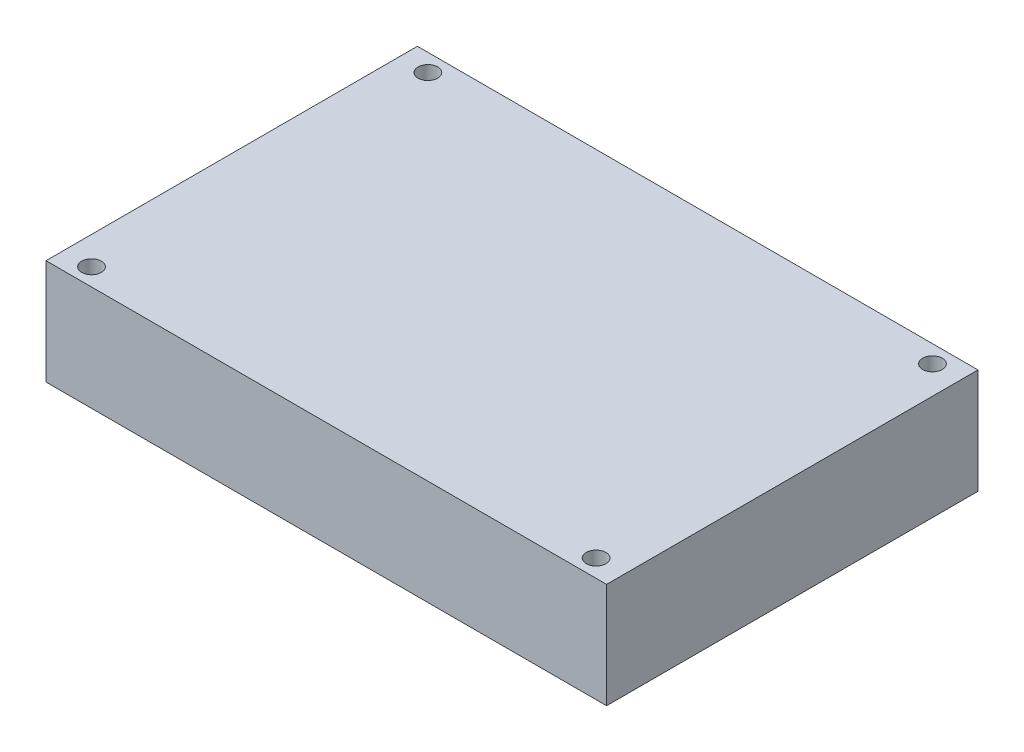
ISO-10303-21;
HEADER;
FILE_DESCRIPTION(('STEP AP214'),'2;1');
FILE_NAME('part.step','',(''),(''),'','','');
FILE_SCHEMA(('AUTOMOTIVE_DESIGN { 1 0 10303 214 1 1 1 1 }'));
ENDSEC;
DATA;
#1=APPLICATION_CONTEXT('core data for automotive mechanical design processes');
#2=APPLICATION_PROTOCOL_DEFINITION('international standard','automotive_design',2000,#1);
#3=PRODUCT_CONTEXT('',#1,'mechanical');
#4=PRODUCT('Part','Part','',(#3));
#5=PRODUCT_RELATED_PRODUCT_CATEGORY('part','',(#4));
#6=PRODUCT_DEFINITION_FORMATION('','',#4);
#7=PRODUCT_DEFINITION_CONTEXT('part definition',#1,'design');
#8=PRODUCT_DEFINITION('design','',#6,#7);
#9=PRODUCT_DEFINITION_SHAPE('','',#8);
#10=(LENGTH_UNIT() NAMED_UNIT(*) SI_UNIT(.MILLI.,.METRE.));
#11=(NAMED_UNIT(*) PLANE_ANGLE_UNIT() SI_UNIT($,.RADIAN.));
#12=(NAMED_UNIT(*) SI_UNIT($,.STERADIAN.) SOLID_ANGLE_UNIT());
#13=UNCERTAINTY_MEASURE_WITH_UNIT(LENGTH_MEASURE(1.E-05),#10,'distance_accuracy_value','');
#14=(GEOMETRIC_REPRESENTATION_CONTEXT(3) GLOBAL_UNCERTAINTY_ASSIGNED_CONTEXT((#13)) GLOBAL_UNIT_ASSIGNED_CONTEXT((#10,
#11,#12)) REPRESENTATION_CONTEXT('',''));
#15=CARTESIAN_POINT('',(0.,0.,0.));
#16=DIRECTION('',(0.,0.,1.));
#17=DIRECTION('',(1.,0.,0.));
#18=AXIS2_PLACEMENT_3D('',#15,#16,#17);
#19=CARTESIAN_POINT('',(0.,15.,0.));
#20=DIRECTION('',(0.,-1.,0.));
#21=DIRECTION('',(0.,0.,-1.));
#22=AXIS2_PLACEMENT_3D('',#19,#20,#21);
#23=PLANE('',#22);
#24=DIRECTION('',(-1.,0.,0.));
#25=VECTOR('',#24,1.);
#26=CARTESIAN_POINT('',(41.5000000000001,15.,-52.9999999999999));
#27=LINE('',#26,#25);
#28=CARTESIAN_POINT('',(80.0000000000001,15.,-52.9999999999999));
#29=VERTEX_POINT('',#28);
#30=CARTESIAN_POINT('',(0.,15.,-52.9999999999999));
#31=VERTEX_POINT('',#30);
#32=EDGE_CURVE('E80',#29,#31,#27,.T.);
#33=ORIENTED_EDGE('',*,*,#32,.T.);
#34=DIRECTION('',(0.,0.,1.));
#35=VECTOR('',#34,1.);
#36=CARTESIAN_POINT('',(0.,15.,0.));
#37=LINE('',#36,#35);
#38=CARTESIAN_POINT('',(0.,15.,0.));
#39=VERTEX_POINT('',#38);
#40=EDGE_CURVE('E83',#31,#39,#37,.T.);
#41=ORIENTED_EDGE('',*,*,#40,.T.);
#42=DIRECTION('',(1.,0.,0.));
#43=VECTOR('',#42,1.);
#44=CARTESIAN_POINT('',(0.,15.,0.));
#45=LINE('',#44,#43);
#46=CARTESIAN_POINT('',(80.0000000000001,15.,0.));
#47=VERTEX_POINT('',#46);
#48=EDGE_CURVE('E87',#39,#47,#45,.T.);
#49=ORIENTED_EDGE('',*,*,#48,.T.);
#50=DIRECTION('',(0.,0.,-1.));
#51=VECTOR('',#50,1.);
#52=CARTESIAN_POINT('',(80.0000000000001,15.,-52.9999999999999));
#53=LINE('',#52,#51);
#54=EDGE_CURVE('E51',#47,#29,#53,.T.);
#55=ORIENTED_EDGE('',*,*,#54,.T.);
#56=EDGE_LOOP('',(#33,#41,#49,#55));
#57=FACE_BOUND('',#56,.T.);
#58=CARTESIAN_POINT('',(76.0000000000001,15.,-50.5));
#59=DIRECTION('',(0.,1.,0.));
#60=DIRECTION('',(0.,0.,1.));
#61=AXIS2_PLACEMENT_3D('',#58,#59,#60);
#62=CIRCLE('',#61,1.39999999999985);
#63=CARTESIAN_POINT('',(76.0000000000001,15.,-49.1000000000001));
#64=VERTEX_POINT('',#63);
#65=EDGE_CURVE('E100',#64,#64,#62,.T.);
#66=ORIENTED_EDGE('',*,*,#65,.F.);
#67=EDGE_LOOP('',(#66));
#68=FACE_BOUND('',#67,.T.);
#69=CARTESIAN_POINT('',(76.0000000000001,15.,-2.49999999999995));
#70=DIRECTION('',(0.,1.,0.));
#71=DIRECTION('',(0.,0.,1.));
#72=AXIS2_PLACEMENT_3D('',#69,#70,#71);
#73=CIRCLE('',#72,1.39999999999985);
#74=CARTESIAN_POINT('',(76.0000000000001,15.,-1.1000000000001));
#75=VERTEX_POINT('',#74);
#76=EDGE_CURVE('E133',#75,#75,#73,.T.);
#77=ORIENTED_EDGE('',*,*,#76,.F.);
#78=EDGE_LOOP('',(#77));
#79=FACE_BOUND('',#78,.T.);
#80=CARTESIAN_POINT('',(4.,15.,-50.5));
#81=DIRECTION('',(0.,1.,0.));
#82=DIRECTION('',(0.,0.,1.));
#83=AXIS2_PLACEMENT_3D('',#80,#81,#82);
#84=CIRCLE('',#83,1.39999999999996);
#85=CARTESIAN_POINT('',(4.,15.,-49.1));
#86=VERTEX_POINT('',#85);
#87=EDGE_CURVE('E128',#86,#86,#84,.T.);
#88=ORIENTED_EDGE('',*,*,#87,.F.);
#89=EDGE_LOOP('',(#88));
#90=FACE_BOUND('',#89,.T.);
#91=CARTESIAN_POINT('',(4.,15.,-2.49999999999995));
#92=DIRECTION('',(0.,1.,0.));
#93=DIRECTION('',(0.,0.,1.));
#94=AXIS2_PLACEMENT_3D('',#91,#92,#93);
#95=CIRCLE('',#94,1.39999999999996);
#96=CARTESIAN_POINT('',(4.,15.,-1.09999999999999));
#97=VERTEX_POINT('',#96);
#98=EDGE_CURVE('E122',#97,#97,#95,.T.);
#99=ORIENTED_EDGE('',*,*,#98,.F.);
#100=EDGE_LOOP('',(#99));
#101=FACE_BOUND('',#100,.T.);
#102=ADVANCED_FACE('F34',(#57,#68,#79,#90,#101),#23,.F.);
#103=CARTESIAN_POINT('',(0.,0.,0.));
#104=DIRECTION('',(0.,-1.,0.));
#105=DIRECTION('',(0.,0.,-1.));
#106=AXIS2_PLACEMENT_3D('',#103,#104,#105);
#107=PLANE('',#106);
#108=CARTESIAN_POINT('',(4.,0.,-50.5));
#109=DIRECTION('',(0.,1.,0.));
#110=DIRECTION('',(0.,0.,1.));
#111=AXIS2_PLACEMENT_3D('',#108,#109,#110);
#112=CIRCLE('',#111,1.39999999999996);
#113=CARTESIAN_POINT('',(4.,0.,-49.1));
#114=VERTEX_POINT('',#113);
#115=EDGE_CURVE('E125',#114,#114,#112,.T.);
#116=ORIENTED_EDGE('',*,*,#115,.T.);
#117=EDGE_LOOP('',(#116));
#118=FACE_BOUND('',#117,.T.);
#119=CARTESIAN_POINT('',(76.0000000000001,0.,-50.5));
#120=DIRECTION('',(0.,1.,0.));
#121=DIRECTION('',(0.,0.,1.));
#122=AXIS2_PLACEMENT_3D('',#119,#120,#121);
#123=CIRCLE('',#122,1.39999999999985);
#124=CARTESIAN_POINT('',(76.0000000000001,0.,-49.1000000000001));
#125=VERTEX_POINT('',#124);
#126=EDGE_CURVE('E136',#125,#125,#123,.T.);
#127=ORIENTED_EDGE('',*,*,#126,.T.);
#128=EDGE_LOOP('',(#127));
#129=FACE_BOUND('',#128,.T.);
#130=DIRECTION('',(-1.,0.,0.));
#131=VECTOR('',#130,1.);
#132=CARTESIAN_POINT('',(0.,0.,-52.9999999999999));
#133=LINE('',#132,#131);
#134=CARTESIAN_POINT('',(80.0000000000001,0.,-52.9999999999999));
#135=VERTEX_POINT('',#134);
#136=CARTESIAN_POINT('',(0.,0.,-52.9999999999999));
#137=VERTEX_POINT('',#136);
#138=EDGE_CURVE('E75',#135,#137,#133,.T.);
#139=ORIENTED_EDGE('',*,*,#138,.F.);
#140=DIRECTION('',(0.,0.,-1.));
#141=VECTOR('',#140,1.);
#142=CARTESIAN_POINT('',(80.0000000000001,0.,-52.9999999999999));
#143=LINE('',#142,#141);
#144=CARTESIAN_POINT('',(80.0000000000001,0.,0.));
#145=VERTEX_POINT('',#144);
#146=EDGE_CURVE('E103',#145,#135,#143,.T.);
#147=ORIENTED_EDGE('',*,*,#146,.F.);
#148=DIRECTION('',(1.,0.,0.));
#149=VECTOR('',#148,1.);
#150=CARTESIAN_POINT('',(0.,0.,0.));
#151=LINE('',#150,#149);
#152=CARTESIAN_POINT('',(0.,0.,0.));
#153=VERTEX_POINT('',#152);
#154=EDGE_CURVE('E68',#153,#145,#151,.T.);
#155=ORIENTED_EDGE('',*,*,#154,.F.);
#156=DIRECTION('',(0.,0.,1.));
#157=VECTOR('',#156,1.);
#158=CARTESIAN_POINT('',(0.,0.,0.));
#159=LINE('',#158,#157);
#160=EDGE_CURVE('E91',#137,#153,#159,.T.);
#161=ORIENTED_EDGE('',*,*,#160,.F.);
#162=EDGE_LOOP('',(#139,#147,#155,#161));
#163=FACE_BOUND('',#162,.T.);
#164=CARTESIAN_POINT('',(76.0000000000001,0.,-2.49999999999995));
#165=DIRECTION('',(0.,1.,0.));
#166=DIRECTION('',(0.,0.,1.));
#167=AXIS2_PLACEMENT_3D('',#164,#165,#166);
#168=CIRCLE('',#167,1.39999999999985);
#169=CARTESIAN_POINT('',(76.0000000000001,0.,-1.1000000000001));
#170=VERTEX_POINT('',#169);
#171=EDGE_CURVE('E117',#170,#170,#168,.T.);
#172=ORIENTED_EDGE('',*,*,#171,.T.);
#173=EDGE_LOOP('',(#172));
#174=FACE_BOUND('',#173,.T.);
#175=CARTESIAN_POINT('',(4.,0.,-2.49999999999995));
#176=DIRECTION('',(0.,1.,0.));
#177=DIRECTION('',(0.,0.,1.));
#178=AXIS2_PLACEMENT_3D('',#175,#176,#177);
#179=CIRCLE('',#178,1.39999999999996);
#180=CARTESIAN_POINT('',(4.,0.,-1.09999999999999));
#181=VERTEX_POINT('',#180);
#182=EDGE_CURVE('E120',#181,#181,#179,.T.);
#183=ORIENTED_EDGE('',*,*,#182,.T.);
#184=EDGE_LOOP('',(#183));
#185=FACE_BOUND('',#184,.T.);
#186=ADVANCED_FACE('F109',(#118,#129,#163,#174,#185),#107,.T.);
#187=CARTESIAN_POINT('',(0.,15.,-52.9999999999999));
#188=DIRECTION('',(0.,0.,1.));
#189=DIRECTION('',(1.,0.,0.));
#190=AXIS2_PLACEMENT_3D('',#187,#188,#189);
#191=PLANE('',#190);
#192=ORIENTED_EDGE('',*,*,#138,.T.);
#193=DIRECTION('',(0.,-1.,0.));
#194=VECTOR('',#193,1.);
#195=CARTESIAN_POINT('',(0.,15.,-52.9999999999999));
#196=LINE('',#195,#194);
#197=EDGE_CURVE('E11',#31,#137,#196,.T.);
#198=ORIENTED_EDGE('',*,*,#197,.F.);
#199=ORIENTED_EDGE('',*,*,#32,.F.);
#200=DIRECTION('',(0.,-1.,0.));
#201=VECTOR('',#200,1.);
#202=CARTESIAN_POINT('',(80.0000000000001,15.,-52.9999999999999));
#203=LINE('',#202,#201);
#204=EDGE_CURVE('E95',#29,#135,#203,.T.);
#205=ORIENTED_EDGE('',*,*,#204,.T.);
#206=EDGE_LOOP('',(#192,#198,#199,#205));
#207=FACE_BOUND('',#206,.T.);
#208=ADVANCED_FACE('F36',(#207),#191,.F.);
#209=CARTESIAN_POINT('',(0.,15.,0.));
#210=DIRECTION('',(1.,0.,0.));
#211=DIRECTION('',(0.,0.,-1.));
#212=AXIS2_PLACEMENT_3D('',#209,#210,#211);
#213=PLANE('',#212);
#214=ORIENTED_EDGE('',*,*,#160,.T.);
#215=DIRECTION('',(0.,-1.,0.));
#216=VECTOR('',#215,1.);
#217=CARTESIAN_POINT('',(0.,15.,0.));
#218=LINE('',#217,#216);
#219=EDGE_CURVE('E43',#39,#153,#218,.T.);
#220=ORIENTED_EDGE('',*,*,#219,.F.);
#221=ORIENTED_EDGE('',*,*,#40,.F.);
#222=ORIENTED_EDGE('',*,*,#197,.T.);
#223=EDGE_LOOP('',(#214,#220,#221,#222));
#224=FACE_BOUND('',#223,.T.);
#225=ADVANCED_FACE('F90',(#224),#213,.F.);
#226=CARTESIAN_POINT('',(0.,15.,0.));
#227=DIRECTION('',(0.,0.,-1.));
#228=DIRECTION('',(-1.,0.,0.));
#229=AXIS2_PLACEMENT_3D('',#226,#227,#228);
#230=PLANE('',#229);
#231=ORIENTED_EDGE('',*,*,#154,.T.);
#232=DIRECTION('',(0.,-1.,0.));
#233=VECTOR('',#232,1.);
#234=CARTESIAN_POINT('',(80.0000000000001,15.,0.));
#235=LINE('',#234,#233);
#236=EDGE_CURVE('E92',#47,#145,#235,.T.);
#237=ORIENTED_EDGE('',*,*,#236,.F.);
#238=ORIENTED_EDGE('',*,*,#48,.F.);
#239=ORIENTED_EDGE('',*,*,#219,.T.);
#240=EDGE_LOOP('',(#231,#237,#238,#239));
#241=FACE_BOUND('',#240,.T.);
#242=ADVANCED_FACE('F93',(#241),#230,.F.);
#243=CARTESIAN_POINT('',(80.0000000000001,15.,-52.9999999999999));
#244=DIRECTION('',(-1.,0.,0.));
#245=DIRECTION('',(0.,0.,1.));
#246=AXIS2_PLACEMENT_3D('',#243,#244,#245);
#247=PLANE('',#246);
#248=ORIENTED_EDGE('',*,*,#146,.T.);
#249=ORIENTED_EDGE('',*,*,#204,.F.);
#250=ORIENTED_EDGE('',*,*,#54,.F.);
#251=ORIENTED_EDGE('',*,*,#236,.T.);
#252=EDGE_LOOP('',(#248,#249,#250,#251));
#253=FACE_BOUND('',#252,.T.);
#254=ADVANCED_FACE('F108',(#253),#247,.F.);
#255=CARTESIAN_POINT('',(76.0000000000001,15.,-50.5));
#256=DIRECTION('',(0.,-1.,0.));
#257=DIRECTION('',(0.,0.,-1.));
#258=AXIS2_PLACEMENT_3D('',#255,#256,#257);
#259=CYLINDRICAL_SURFACE('',#258,1.39999999999985);
#260=ORIENTED_EDGE('',*,*,#65,.T.);
#261=EDGE_LOOP('',(#260));
#262=FACE_BOUND('',#261,.T.);
#263=ORIENTED_EDGE('',*,*,#126,.F.);
#264=EDGE_LOOP('',(#263));
#265=FACE_BOUND('',#264,.T.);
#266=ADVANCED_FACE('F144',(#262,#265),#259,.F.);
#267=CARTESIAN_POINT('',(76.0000000000001,15.,-2.49999999999995));
#268=DIRECTION('',(0.,-1.,0.));
#269=DIRECTION('',(0.,0.,-1.));
#270=AXIS2_PLACEMENT_3D('',#267,#268,#269);
#271=CYLINDRICAL_SURFACE('',#270,1.39999999999985);
#272=ORIENTED_EDGE('',*,*,#76,.T.);
#273=EDGE_LOOP('',(#272));
#274=FACE_BOUND('',#273,.T.);
#275=ORIENTED_EDGE('',*,*,#171,.F.);
#276=EDGE_LOOP('',(#275));
#277=FACE_BOUND('',#276,.T.);
#278=ADVANCED_FACE('F146',(#274,#277),#271,.F.);
#279=CARTESIAN_POINT('',(4.,15.,-50.5));
#280=DIRECTION('',(0.,-1.,0.));
#281=DIRECTION('',(0.,0.,-1.));
#282=AXIS2_PLACEMENT_3D('',#279,#280,#281);
#283=CYLINDRICAL_SURFACE('',#282,1.39999999999996);
#284=ORIENTED_EDGE('',*,*,#87,.T.);
#285=EDGE_LOOP('',(#284));
#286=FACE_BOUND('',#285,.T.);
#287=ORIENTED_EDGE('',*,*,#115,.F.);
#288=EDGE_LOOP('',(#287));
#289=FACE_BOUND('',#288,.T.);
#290=ADVANCED_FACE('F153',(#286,#289),#283,.F.);
#291=CARTESIAN_POINT('',(4.,15.,-2.49999999999995));
#292=DIRECTION('',(0.,-1.,0.));
#293=DIRECTION('',(0.,0.,-1.));
#294=AXIS2_PLACEMENT_3D('',#291,#292,#293);
#295=CYLINDRICAL_SURFACE('',#294,1.39999999999996);
#296=ORIENTED_EDGE('',*,*,#98,.T.);
#297=EDGE_LOOP('',(#296));
#298=FACE_BOUND('',#297,.T.);
#299=ORIENTED_EDGE('',*,*,#182,.F.);
#300=EDGE_LOOP('',(#299));
#301=FACE_BOUND('',#300,.T.);
#302=ADVANCED_FACE('F219',(#298,#301),#295,.F.);
#303=CLOSED_SHELL('',(#102,#186,#208,#225,#242,#254,#266,#278,#290,#302));
#304=MANIFOLD_SOLID_BREP('B2',#303);
#305=ADVANCED_BREP_SHAPE_REPRESENTATION('',(#18,#304),#14);
#306=SHAPE_DEFINITION_REPRESENTATION(#9,#305);
ENDSEC;
END-ISO-10303-21;
